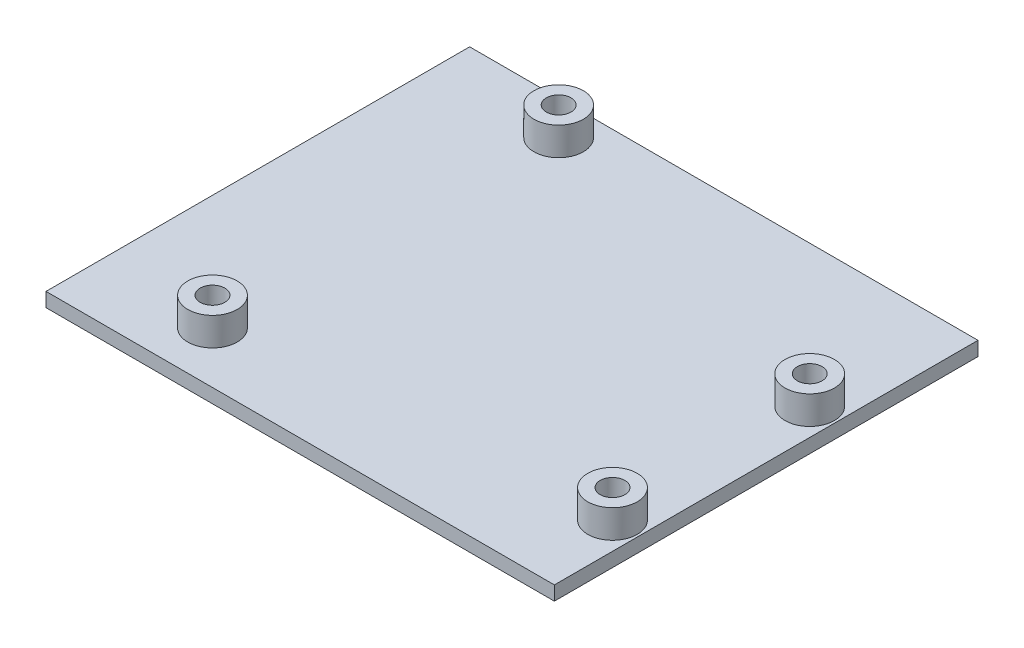
ISO-10303-21;
HEADER;
FILE_DESCRIPTION(('STEP AP214'),'2;1');
FILE_NAME('part.step','',(''),(''),'','','');
FILE_SCHEMA(('AUTOMOTIVE_DESIGN { 1 0 10303 214 1 1 1 1 }'));
ENDSEC;
DATA;
#1=APPLICATION_CONTEXT('core data for automotive mechanical design processes');
#2=APPLICATION_PROTOCOL_DEFINITION('international standard','automotive_design',2000,#1);
#3=PRODUCT_CONTEXT('',#1,'mechanical');
#4=PRODUCT('Part','Part','',(#3));
#5=PRODUCT_RELATED_PRODUCT_CATEGORY('part','',(#4));
#6=PRODUCT_DEFINITION_FORMATION('','',#4);
#7=PRODUCT_DEFINITION_CONTEXT('part definition',#1,'design');
#8=PRODUCT_DEFINITION('design','',#6,#7);
#9=PRODUCT_DEFINITION_SHAPE('','',#8);
#10=(LENGTH_UNIT() NAMED_UNIT(*) SI_UNIT(.MILLI.,.METRE.));
#11=(NAMED_UNIT(*) PLANE_ANGLE_UNIT() SI_UNIT($,.RADIAN.));
#12=(NAMED_UNIT(*) SI_UNIT($,.STERADIAN.) SOLID_ANGLE_UNIT());
#13=UNCERTAINTY_MEASURE_WITH_UNIT(LENGTH_MEASURE(1.E-05),#10,'distance_accuracy_value','');
#14=(GEOMETRIC_REPRESENTATION_CONTEXT(3) GLOBAL_UNCERTAINTY_ASSIGNED_CONTEXT((#13)) GLOBAL_UNIT_ASSIGNED_CONTEXT((#10,
#11,#12)) REPRESENTATION_CONTEXT('',''));
#15=CARTESIAN_POINT('',(0.,0.,0.));
#16=DIRECTION('',(0.,0.,1.));
#17=DIRECTION('',(1.,0.,0.));
#18=AXIS2_PLACEMENT_3D('',#15,#16,#17);
#19=CARTESIAN_POINT('',(-36.,2.,-30.));
#20=DIRECTION('',(1.,0.,0.));
#21=DIRECTION('',(0.,0.,-1.));
#22=AXIS2_PLACEMENT_3D('',#19,#20,#21);
#23=PLANE('',#22);
#24=DIRECTION('',(0.,0.,1.));
#25=VECTOR('',#24,1.);
#26=CARTESIAN_POINT('',(-36.,0.,-30.));
#27=LINE('',#26,#25);
#28=CARTESIAN_POINT('',(-36.,0.,-30.));
#29=VERTEX_POINT('',#28);
#30=CARTESIAN_POINT('',(-36.,0.,30.));
#31=VERTEX_POINT('',#30);
#32=EDGE_CURVE('E101',#29,#31,#27,.T.);
#33=ORIENTED_EDGE('',*,*,#32,.T.);
#34=DIRECTION('',(0.,-1.,0.));
#35=VECTOR('',#34,1.);
#36=CARTESIAN_POINT('',(-36.,2.,30.));
#37=LINE('',#36,#35);
#38=CARTESIAN_POINT('',(-36.,2.,30.));
#39=VERTEX_POINT('',#38);
#40=EDGE_CURVE('E92',#39,#31,#37,.T.);
#41=ORIENTED_EDGE('',*,*,#40,.F.);
#42=DIRECTION('',(0.,0.,1.));
#43=VECTOR('',#42,1.);
#44=CARTESIAN_POINT('',(-36.,2.,-30.));
#45=LINE('',#44,#43);
#46=CARTESIAN_POINT('',(-36.,2.,-30.));
#47=VERTEX_POINT('',#46);
#48=EDGE_CURVE('E86',#47,#39,#45,.T.);
#49=ORIENTED_EDGE('',*,*,#48,.F.);
#50=DIRECTION('',(0.,-1.,0.));
#51=VECTOR('',#50,1.);
#52=CARTESIAN_POINT('',(-36.,2.,-30.));
#53=LINE('',#52,#51);
#54=EDGE_CURVE('E97',#47,#29,#53,.T.);
#55=ORIENTED_EDGE('',*,*,#54,.T.);
#56=EDGE_LOOP('',(#33,#41,#49,#55));
#57=FACE_BOUND('',#56,.T.);
#58=ADVANCED_FACE('F34',(#57),#23,.F.);
#59=CARTESIAN_POINT('',(36.,2.,30.));
#60=DIRECTION('',(0.,0.,-1.));
#61=DIRECTION('',(-1.,0.,0.));
#62=AXIS2_PLACEMENT_3D('',#59,#60,#61);
#63=PLANE('',#62);
#64=DIRECTION('',(1.,0.,0.));
#65=VECTOR('',#64,1.);
#66=CARTESIAN_POINT('',(36.,0.,30.));
#67=LINE('',#66,#65);
#68=CARTESIAN_POINT('',(36.,0.,30.));
#69=VERTEX_POINT('',#68);
#70=EDGE_CURVE('E91',#31,#69,#67,.T.);
#71=ORIENTED_EDGE('',*,*,#70,.T.);
#72=DIRECTION('',(0.,-1.,0.));
#73=VECTOR('',#72,1.);
#74=CARTESIAN_POINT('',(36.,2.,30.));
#75=LINE('',#74,#73);
#76=CARTESIAN_POINT('',(36.,2.,30.));
#77=VERTEX_POINT('',#76);
#78=EDGE_CURVE('E89',#77,#69,#75,.T.);
#79=ORIENTED_EDGE('',*,*,#78,.F.);
#80=DIRECTION('',(1.,0.,0.));
#81=VECTOR('',#80,1.);
#82=CARTESIAN_POINT('',(36.,2.,30.));
#83=LINE('',#82,#81);
#84=EDGE_CURVE('E81',#39,#77,#83,.T.);
#85=ORIENTED_EDGE('',*,*,#84,.F.);
#86=ORIENTED_EDGE('',*,*,#40,.T.);
#87=EDGE_LOOP('',(#71,#79,#85,#86));
#88=FACE_BOUND('',#87,.T.);
#89=ADVANCED_FACE('F90',(#88),#63,.F.);
#90=CARTESIAN_POINT('',(36.,2.,-30.));
#91=DIRECTION('',(-1.,0.,0.));
#92=DIRECTION('',(0.,0.,1.));
#93=AXIS2_PLACEMENT_3D('',#90,#91,#92);
#94=PLANE('',#93);
#95=DIRECTION('',(0.,0.,-1.));
#96=VECTOR('',#95,1.);
#97=CARTESIAN_POINT('',(36.,0.,-30.));
#98=LINE('',#97,#96);
#99=CARTESIAN_POINT('',(36.,0.,-30.));
#100=VERTEX_POINT('',#99);
#101=EDGE_CURVE('E67',#69,#100,#98,.T.);
#102=ORIENTED_EDGE('',*,*,#101,.T.);
#103=DIRECTION('',(0.,-1.,0.));
#104=VECTOR('',#103,1.);
#105=CARTESIAN_POINT('',(36.,2.,-30.));
#106=LINE('',#105,#104);
#107=CARTESIAN_POINT('',(36.,2.,-30.));
#108=VERTEX_POINT('',#107);
#109=EDGE_CURVE('E93',#108,#100,#106,.T.);
#110=ORIENTED_EDGE('',*,*,#109,.F.);
#111=DIRECTION('',(0.,0.,-1.));
#112=VECTOR('',#111,1.);
#113=CARTESIAN_POINT('',(36.,2.,-30.));
#114=LINE('',#113,#112);
#115=EDGE_CURVE('E84',#77,#108,#114,.T.);
#116=ORIENTED_EDGE('',*,*,#115,.F.);
#117=ORIENTED_EDGE('',*,*,#78,.T.);
#118=EDGE_LOOP('',(#102,#110,#116,#117));
#119=FACE_BOUND('',#118,.T.);
#120=ADVANCED_FACE('F95',(#119),#94,.F.);
#121=CARTESIAN_POINT('',(36.,2.,-30.));
#122=DIRECTION('',(0.,0.,1.));
#123=DIRECTION('',(1.,0.,0.));
#124=AXIS2_PLACEMENT_3D('',#121,#122,#123);
#125=PLANE('',#124);
#126=DIRECTION('',(-1.,0.,0.));
#127=VECTOR('',#126,1.);
#128=CARTESIAN_POINT('',(36.,0.,-30.));
#129=LINE('',#128,#127);
#130=EDGE_CURVE('E73',#100,#29,#129,.T.);
#131=ORIENTED_EDGE('',*,*,#130,.T.);
#132=ORIENTED_EDGE('',*,*,#54,.F.);
#133=DIRECTION('',(-1.,0.,0.));
#134=VECTOR('',#133,1.);
#135=CARTESIAN_POINT('',(36.,2.,-30.));
#136=LINE('',#135,#134);
#137=EDGE_CURVE('E50',#108,#47,#136,.T.);
#138=ORIENTED_EDGE('',*,*,#137,.F.);
#139=ORIENTED_EDGE('',*,*,#109,.T.);
#140=EDGE_LOOP('',(#131,#132,#138,#139));
#141=FACE_BOUND('',#140,.T.);
#142=ADVANCED_FACE('F124',(#141),#125,.F.);
#143=CARTESIAN_POINT('',(0.,2.,0.));
#144=DIRECTION('',(0.,-1.,0.));
#145=DIRECTION('',(0.,0.,-1.));
#146=AXIS2_PLACEMENT_3D('',#143,#144,#145);
#147=PLANE('',#146);
#148=CARTESIAN_POINT('',(-18.564843267205,2.,-25.1733137110079));
#149=DIRECTION('',(0.,-1.,0.));
#150=DIRECTION('',(0.,0.,-1.));
#151=AXIS2_PLACEMENT_3D('',#148,#149,#150);
#152=CIRCLE('',#151,3.5);
#153=CARTESIAN_POINT('',(-18.564843267205,2.,-28.6733137110079));
#154=VERTEX_POINT('',#153);
#155=EDGE_CURVE('E11',#154,#154,#152,.F.);
#156=ORIENTED_EDGE('',*,*,#155,.F.);
#157=EDGE_LOOP('',(#156));
#158=FACE_BOUND('',#157,.T.);
#159=CARTESIAN_POINT('',(32.1807879094024,2.,-9.98662066438014));
#160=DIRECTION('',(0.,-1.,0.));
#161=DIRECTION('',(0.,0.,-1.));
#162=AXIS2_PLACEMENT_3D('',#159,#160,#161);
#163=CIRCLE('',#162,3.5);
#164=CARTESIAN_POINT('',(32.1807879094024,2.,-13.4866206643801));
#165=VERTEX_POINT('',#164);
#166=EDGE_CURVE('E42',#165,#165,#163,.F.);
#167=ORIENTED_EDGE('',*,*,#166,.F.);
#168=EDGE_LOOP('',(#167));
#169=FACE_BOUND('',#168,.T.);
#170=CARTESIAN_POINT('',(32.1770045697486,2.,17.9412177909837));
#171=DIRECTION('',(0.,-1.,0.));
#172=DIRECTION('',(0.,0.,-1.));
#173=AXIS2_PLACEMENT_3D('',#170,#171,#172);
#174=CIRCLE('',#173,3.5);
#175=CARTESIAN_POINT('',(32.1770045697486,2.,14.4412177909837));
#176=VERTEX_POINT('',#175);
#177=EDGE_CURVE('E114',#176,#176,#174,.F.);
#178=ORIENTED_EDGE('',*,*,#177,.F.);
#179=EDGE_LOOP('',(#178));
#180=FACE_BOUND('',#179,.T.);
#181=CARTESIAN_POINT('',(-19.7419895782213,2.,22.6772545335993));
#182=DIRECTION('',(0.,-1.,0.));
#183=DIRECTION('',(0.,0.,-1.));
#184=AXIS2_PLACEMENT_3D('',#181,#182,#183);
#185=CIRCLE('',#184,3.5);
#186=CARTESIAN_POINT('',(-19.7419895782213,2.,19.1772545335993));
#187=VERTEX_POINT('',#186);
#188=EDGE_CURVE('E111',#187,#187,#185,.F.);
#189=ORIENTED_EDGE('',*,*,#188,.F.);
#190=EDGE_LOOP('',(#189));
#191=FACE_BOUND('',#190,.T.);
#192=ORIENTED_EDGE('',*,*,#48,.T.);
#193=ORIENTED_EDGE('',*,*,#84,.T.);
#194=ORIENTED_EDGE('',*,*,#115,.T.);
#195=ORIENTED_EDGE('',*,*,#137,.T.);
#196=EDGE_LOOP('',(#192,#193,#194,#195));
#197=FACE_BOUND('',#196,.T.);
#198=ADVANCED_FACE('F82',(#158,#169,#180,#191,#197),#147,.F.);
#199=CARTESIAN_POINT('',(0.,0.,0.));
#200=DIRECTION('',(0.,-1.,0.));
#201=DIRECTION('',(0.,0.,-1.));
#202=AXIS2_PLACEMENT_3D('',#199,#200,#201);
#203=PLANE('',#202);
#204=ORIENTED_EDGE('',*,*,#32,.F.);
#205=ORIENTED_EDGE('',*,*,#130,.F.);
#206=ORIENTED_EDGE('',*,*,#101,.F.);
#207=ORIENTED_EDGE('',*,*,#70,.F.);
#208=EDGE_LOOP('',(#204,#205,#206,#207));
#209=FACE_BOUND('',#208,.T.);
#210=ADVANCED_FACE('F123',(#209),#203,.T.);
#211=CARTESIAN_POINT('',(-19.7419895782213,6.,22.6772545335993));
#212=DIRECTION('',(0.,-1.,0.));
#213=DIRECTION('',(0.,0.,-1.));
#214=AXIS2_PLACEMENT_3D('',#211,#212,#213);
#215=CYLINDRICAL_SURFACE('',#214,3.5);
#216=CARTESIAN_POINT('',(-19.7419895782213,6.,22.6772545335993));
#217=DIRECTION('',(0.,1.,0.));
#218=DIRECTION('',(0.,0.,1.));
#219=AXIS2_PLACEMENT_3D('',#216,#217,#218);
#220=CIRCLE('',#219,3.5);
#221=CARTESIAN_POINT('',(-19.7419895782213,6.,26.1772545335993));
#222=VERTEX_POINT('',#221);
#223=EDGE_CURVE('E104',#222,#222,#220,.T.);
#224=ORIENTED_EDGE('',*,*,#223,.F.);
#225=EDGE_LOOP('',(#224));
#226=FACE_BOUND('',#225,.T.);
#227=ORIENTED_EDGE('',*,*,#188,.T.);
#228=EDGE_LOOP('',(#227));
#229=FACE_BOUND('',#228,.T.);
#230=ADVANCED_FACE('F131',(#226,#229),#215,.T.);
#231=CARTESIAN_POINT('',(-19.7419895782213,6.,22.6772545335993));
#232=DIRECTION('',(0.,1.,0.));
#233=DIRECTION('',(0.,0.,1.));
#234=AXIS2_PLACEMENT_3D('',#231,#232,#233);
#235=PLANE('',#234);
#236=CARTESIAN_POINT('',(-19.7419895782213,6.,22.6772545335993));
#237=DIRECTION('',(0.,1.,0.));
#238=DIRECTION('',(0.,0.,1.));
#239=AXIS2_PLACEMENT_3D('',#236,#237,#238);
#240=CIRCLE('',#239,1.75);
#241=CARTESIAN_POINT('',(-19.7419895782213,6.,24.4272545335993));
#242=VERTEX_POINT('',#241);
#243=EDGE_CURVE('E340',#242,#242,#240,.T.);
#244=ORIENTED_EDGE('',*,*,#243,.F.);
#245=EDGE_LOOP('',(#244));
#246=FACE_BOUND('',#245,.T.);
#247=ORIENTED_EDGE('',*,*,#223,.T.);
#248=EDGE_LOOP('',(#247));
#249=FACE_BOUND('',#248,.T.);
#250=ADVANCED_FACE('F133',(#246,#249),#235,.T.);
#251=CARTESIAN_POINT('',(32.1770045697486,6.,17.9412177909837));
#252=DIRECTION('',(0.,-1.,0.));
#253=DIRECTION('',(0.,0.,-1.));
#254=AXIS2_PLACEMENT_3D('',#251,#252,#253);
#255=CYLINDRICAL_SURFACE('',#254,3.5);
#256=CARTESIAN_POINT('',(32.1770045697486,6.,17.9412177909837));
#257=DIRECTION('',(0.,1.,0.));
#258=DIRECTION('',(0.,0.,1.));
#259=AXIS2_PLACEMENT_3D('',#256,#257,#258);
#260=CIRCLE('',#259,3.5);
#261=CARTESIAN_POINT('',(32.1770045697486,6.,21.4412177909837));
#262=VERTEX_POINT('',#261);
#263=EDGE_CURVE('E354',#262,#262,#260,.T.);
#264=ORIENTED_EDGE('',*,*,#263,.F.);
#265=EDGE_LOOP('',(#264));
#266=FACE_BOUND('',#265,.T.);
#267=ORIENTED_EDGE('',*,*,#177,.T.);
#268=EDGE_LOOP('',(#267));
#269=FACE_BOUND('',#268,.T.);
#270=ADVANCED_FACE('F140',(#266,#269),#255,.T.);
#271=CARTESIAN_POINT('',(32.1770045697486,6.,17.9412177909837));
#272=DIRECTION('',(0.,1.,0.));
#273=DIRECTION('',(0.,0.,1.));
#274=AXIS2_PLACEMENT_3D('',#271,#272,#273);
#275=PLANE('',#274);
#276=CARTESIAN_POINT('',(32.1770045697486,6.,17.9412177909837));
#277=DIRECTION('',(0.,1.,0.));
#278=DIRECTION('',(0.,0.,1.));
#279=AXIS2_PLACEMENT_3D('',#276,#277,#278);
#280=CIRCLE('',#279,1.75);
#281=CARTESIAN_POINT('',(32.1770045697486,6.,19.6912177909837));
#282=VERTEX_POINT('',#281);
#283=EDGE_CURVE('E379',#282,#282,#280,.T.);
#284=ORIENTED_EDGE('',*,*,#283,.F.);
#285=EDGE_LOOP('',(#284));
#286=FACE_BOUND('',#285,.T.);
#287=ORIENTED_EDGE('',*,*,#263,.T.);
#288=EDGE_LOOP('',(#287));
#289=FACE_BOUND('',#288,.T.);
#290=ADVANCED_FACE('F205',(#286,#289),#275,.T.);
#291=CARTESIAN_POINT('',(32.1807879094024,6.,-9.98662066438014));
#292=DIRECTION('',(0.,-1.,0.));
#293=DIRECTION('',(0.,0.,-1.));
#294=AXIS2_PLACEMENT_3D('',#291,#292,#293);
#295=CYLINDRICAL_SURFACE('',#294,3.5);
#296=CARTESIAN_POINT('',(32.1807879094024,6.,-9.98662066438014));
#297=DIRECTION('',(0.,1.,0.));
#298=DIRECTION('',(0.,0.,1.));
#299=AXIS2_PLACEMENT_3D('',#296,#297,#298);
#300=CIRCLE('',#299,3.5);
#301=CARTESIAN_POINT('',(32.1807879094024,6.,-6.48662066438014));
#302=VERTEX_POINT('',#301);
#303=EDGE_CURVE('E350',#302,#302,#300,.T.);
#304=ORIENTED_EDGE('',*,*,#303,.F.);
#305=EDGE_LOOP('',(#304));
#306=FACE_BOUND('',#305,.T.);
#307=ORIENTED_EDGE('',*,*,#166,.T.);
#308=EDGE_LOOP('',(#307));
#309=FACE_BOUND('',#308,.T.);
#310=ADVANCED_FACE('F119',(#306,#309),#295,.T.);
#311=CARTESIAN_POINT('',(32.1807879094024,6.,-9.98662066438014));
#312=DIRECTION('',(0.,1.,0.));
#313=DIRECTION('',(0.,0.,1.));
#314=AXIS2_PLACEMENT_3D('',#311,#312,#313);
#315=PLANE('',#314);
#316=CARTESIAN_POINT('',(32.1807879094024,6.,-9.98662066438014));
#317=DIRECTION('',(0.,1.,0.));
#318=DIRECTION('',(0.,0.,1.));
#319=AXIS2_PLACEMENT_3D('',#316,#317,#318);
#320=CIRCLE('',#319,1.75);
#321=CARTESIAN_POINT('',(32.1807879094024,6.,-8.23662066438014));
#322=VERTEX_POINT('',#321);
#323=EDGE_CURVE('E371',#322,#322,#320,.T.);
#324=ORIENTED_EDGE('',*,*,#323,.F.);
#325=EDGE_LOOP('',(#324));
#326=FACE_BOUND('',#325,.T.);
#327=ORIENTED_EDGE('',*,*,#303,.T.);
#328=EDGE_LOOP('',(#327));
#329=FACE_BOUND('',#328,.T.);
#330=ADVANCED_FACE('F222',(#326,#329),#315,.T.);
#331=CARTESIAN_POINT('',(-18.564843267205,6.,-25.1733137110079));
#332=DIRECTION('',(0.,-1.,0.));
#333=DIRECTION('',(0.,0.,-1.));
#334=AXIS2_PLACEMENT_3D('',#331,#332,#333);
#335=CYLINDRICAL_SURFACE('',#334,3.5);
#336=CARTESIAN_POINT('',(-18.564843267205,6.,-25.1733137110079));
#337=DIRECTION('',(0.,1.,0.));
#338=DIRECTION('',(0.,0.,1.));
#339=AXIS2_PLACEMENT_3D('',#336,#337,#338);
#340=CIRCLE('',#339,3.5);
#341=CARTESIAN_POINT('',(-18.564843267205,6.,-21.6733137110079));
#342=VERTEX_POINT('',#341);
#343=EDGE_CURVE('E347',#342,#342,#340,.T.);
#344=ORIENTED_EDGE('',*,*,#343,.F.);
#345=EDGE_LOOP('',(#344));
#346=FACE_BOUND('',#345,.T.);
#347=ORIENTED_EDGE('',*,*,#155,.T.);
#348=EDGE_LOOP('',(#347));
#349=FACE_BOUND('',#348,.T.);
#350=ADVANCED_FACE('F230',(#346,#349),#335,.T.);
#351=CARTESIAN_POINT('',(-18.564843267205,6.,-25.1733137110079));
#352=DIRECTION('',(0.,1.,0.));
#353=DIRECTION('',(0.,0.,1.));
#354=AXIS2_PLACEMENT_3D('',#351,#352,#353);
#355=PLANE('',#354);
#356=CARTESIAN_POINT('',(-18.564843267205,6.,-25.1733137110079));
#357=DIRECTION('',(0.,1.,0.));
#358=DIRECTION('',(0.,0.,1.));
#359=AXIS2_PLACEMENT_3D('',#356,#357,#358);
#360=CIRCLE('',#359,1.75);
#361=CARTESIAN_POINT('',(-18.564843267205,6.,-23.4233137110079));
#362=VERTEX_POINT('',#361);
#363=EDGE_CURVE('E351',#362,#362,#360,.T.);
#364=ORIENTED_EDGE('',*,*,#363,.F.);
#365=EDGE_LOOP('',(#364));
#366=FACE_BOUND('',#365,.T.);
#367=ORIENTED_EDGE('',*,*,#343,.T.);
#368=EDGE_LOOP('',(#367));
#369=FACE_BOUND('',#368,.T.);
#370=ADVANCED_FACE('F239',(#366,#369),#355,.T.);
#371=CARTESIAN_POINT('',(-18.564843267205,6.,-25.1733137110079));
#372=DIRECTION('',(0.,-1.,0.));
#373=DIRECTION('',(0.,0.,-1.));
#374=AXIS2_PLACEMENT_3D('',#371,#372,#373);
#375=CYLINDRICAL_SURFACE('',#374,1.75);
#376=ORIENTED_EDGE('',*,*,#363,.T.);
#377=EDGE_LOOP('',(#376));
#378=FACE_BOUND('',#377,.T.);
#379=CARTESIAN_POINT('',(-18.564843267205,2.,-25.1733137110079));
#380=DIRECTION('',(0.,1.,0.));
#381=DIRECTION('',(0.,0.,1.));
#382=AXIS2_PLACEMENT_3D('',#379,#380,#381);
#383=CIRCLE('',#382,1.75);
#384=CARTESIAN_POINT('',(-18.564843267205,2.,-23.4233137110079));
#385=VERTEX_POINT('',#384);
#386=EDGE_CURVE('E367',#385,#385,#383,.T.);
#387=ORIENTED_EDGE('',*,*,#386,.F.);
#388=EDGE_LOOP('',(#387));
#389=FACE_BOUND('',#388,.T.);
#390=ADVANCED_FACE('F247',(#378,#389),#375,.F.);
#391=CARTESIAN_POINT('',(-18.564843267205,2.,-25.1733137110079));
#392=DIRECTION('',(0.,1.,0.));
#393=DIRECTION('',(0.,0.,1.));
#394=AXIS2_PLACEMENT_3D('',#391,#392,#393);
#395=PLANE('',#394);
#396=ORIENTED_EDGE('',*,*,#386,.T.);
#397=EDGE_LOOP('',(#396));
#398=FACE_BOUND('',#397,.T.);
#399=ADVANCED_FACE('F256',(#398),#395,.T.);
#400=CARTESIAN_POINT('',(32.1807879094024,6.,-9.98662066438014));
#401=DIRECTION('',(0.,-1.,0.));
#402=DIRECTION('',(0.,0.,-1.));
#403=AXIS2_PLACEMENT_3D('',#400,#401,#402);
#404=CYLINDRICAL_SURFACE('',#403,1.75);
#405=ORIENTED_EDGE('',*,*,#323,.T.);
#406=EDGE_LOOP('',(#405));
#407=FACE_BOUND('',#406,.T.);
#408=CARTESIAN_POINT('',(32.1807879094024,2.,-9.98662066438014));
#409=DIRECTION('',(0.,1.,0.));
#410=DIRECTION('',(0.,0.,1.));
#411=AXIS2_PLACEMENT_3D('',#408,#409,#410);
#412=CIRCLE('',#411,1.75);
#413=CARTESIAN_POINT('',(32.1807879094024,2.,-8.23662066438014));
#414=VERTEX_POINT('',#413);
#415=EDGE_CURVE('E376',#414,#414,#412,.T.);
#416=ORIENTED_EDGE('',*,*,#415,.F.);
#417=EDGE_LOOP('',(#416));
#418=FACE_BOUND('',#417,.T.);
#419=ADVANCED_FACE('F265',(#407,#418),#404,.F.);
#420=CARTESIAN_POINT('',(32.1807879094024,2.,-9.98662066438014));
#421=DIRECTION('',(0.,1.,0.));
#422=DIRECTION('',(0.,0.,1.));
#423=AXIS2_PLACEMENT_3D('',#420,#421,#422);
#424=PLANE('',#423);
#425=ORIENTED_EDGE('',*,*,#415,.T.);
#426=EDGE_LOOP('',(#425));
#427=FACE_BOUND('',#426,.T.);
#428=ADVANCED_FACE('F274',(#427),#424,.T.);
#429=CARTESIAN_POINT('',(32.1770045697486,6.,17.9412177909837));
#430=DIRECTION('',(0.,-1.,0.));
#431=DIRECTION('',(0.,0.,-1.));
#432=AXIS2_PLACEMENT_3D('',#429,#430,#431);
#433=CYLINDRICAL_SURFACE('',#432,1.75);
#434=ORIENTED_EDGE('',*,*,#283,.T.);
#435=EDGE_LOOP('',(#434));
#436=FACE_BOUND('',#435,.T.);
#437=CARTESIAN_POINT('',(32.1770045697486,2.,17.9412177909837));
#438=DIRECTION('',(0.,1.,0.));
#439=DIRECTION('',(0.,0.,1.));
#440=AXIS2_PLACEMENT_3D('',#437,#438,#439);
#441=CIRCLE('',#440,1.75);
#442=CARTESIAN_POINT('',(32.1770045697486,2.,19.6912177909837));
#443=VERTEX_POINT('',#442);
#444=EDGE_CURVE('E343',#443,#443,#441,.T.);
#445=ORIENTED_EDGE('',*,*,#444,.F.);
#446=EDGE_LOOP('',(#445));
#447=FACE_BOUND('',#446,.T.);
#448=ADVANCED_FACE('F283',(#436,#447),#433,.F.);
#449=CARTESIAN_POINT('',(32.1770045697486,2.,17.9412177909837));
#450=DIRECTION('',(0.,1.,0.));
#451=DIRECTION('',(0.,0.,1.));
#452=AXIS2_PLACEMENT_3D('',#449,#450,#451);
#453=PLANE('',#452);
#454=ORIENTED_EDGE('',*,*,#444,.T.);
#455=EDGE_LOOP('',(#454));
#456=FACE_BOUND('',#455,.T.);
#457=ADVANCED_FACE('F292',(#456),#453,.T.);
#458=CARTESIAN_POINT('',(-19.7419895782213,6.,22.6772545335993));
#459=DIRECTION('',(0.,-1.,0.));
#460=DIRECTION('',(0.,0.,-1.));
#461=AXIS2_PLACEMENT_3D('',#458,#459,#460);
#462=CYLINDRICAL_SURFACE('',#461,1.75);
#463=ORIENTED_EDGE('',*,*,#243,.T.);
#464=EDGE_LOOP('',(#463));
#465=FACE_BOUND('',#464,.T.);
#466=CARTESIAN_POINT('',(-19.7419895782213,2.,22.6772545335993));
#467=DIRECTION('',(0.,1.,0.));
#468=DIRECTION('',(0.,0.,1.));
#469=AXIS2_PLACEMENT_3D('',#466,#467,#468);
#470=CIRCLE('',#469,1.75);
#471=CARTESIAN_POINT('',(-19.7419895782213,2.,24.4272545335993));
#472=VERTEX_POINT('',#471);
#473=EDGE_CURVE('E338',#472,#472,#470,.T.);
#474=ORIENTED_EDGE('',*,*,#473,.F.);
#475=EDGE_LOOP('',(#474));
#476=FACE_BOUND('',#475,.T.);
#477=ADVANCED_FACE('F301',(#465,#476),#462,.F.);
#478=CARTESIAN_POINT('',(-19.7419895782213,2.,22.6772545335993));
#479=DIRECTION('',(0.,1.,0.));
#480=DIRECTION('',(0.,0.,1.));
#481=AXIS2_PLACEMENT_3D('',#478,#479,#480);
#482=PLANE('',#481);
#483=ORIENTED_EDGE('',*,*,#473,.T.);
#484=EDGE_LOOP('',(#483));
#485=FACE_BOUND('',#484,.T.);
#486=ADVANCED_FACE('F310',(#485),#482,.T.);
#487=CLOSED_SHELL('',(#58,#89,#120,#142,#198,#210,#230,#250,#270,#290,#310,#330,#350,#370,#390,
#399,#419,#428,#448,#457,#477,#486));
#488=MANIFOLD_SOLID_BREP('B2',#487);
#489=ADVANCED_BREP_SHAPE_REPRESENTATION('',(#18,#488),#14);
#490=SHAPE_DEFINITION_REPRESENTATION(#9,#489);
ENDSEC;
END-ISO-10303-21;
